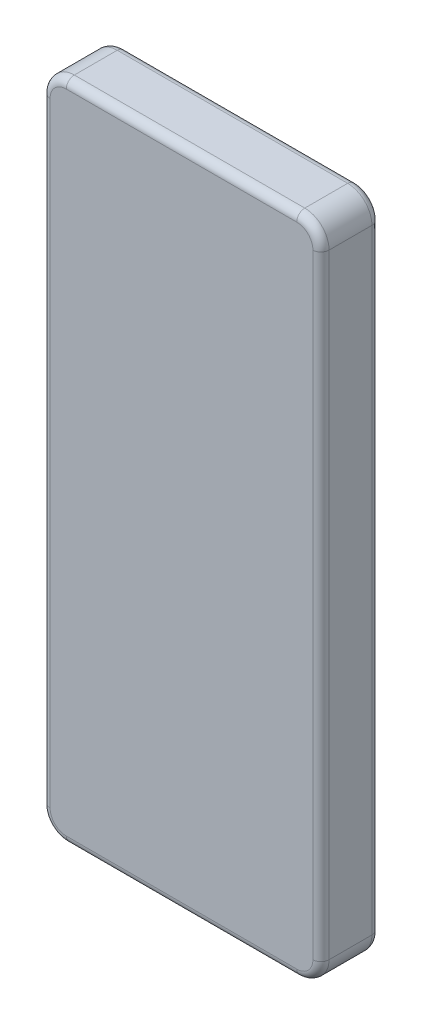
ISO-10303-21;
HEADER;
FILE_DESCRIPTION(('STEP AP214'),'2;1');
FILE_NAME('part.step','',(''),(''),'','','');
FILE_SCHEMA(('AUTOMOTIVE_DESIGN { 1 0 10303 214 1 1 1 1 }'));
ENDSEC;
DATA;
#1=APPLICATION_CONTEXT('core data for automotive mechanical design processes');
#2=APPLICATION_PROTOCOL_DEFINITION('international standard','automotive_design',2000,#1);
#3=PRODUCT_CONTEXT('',#1,'mechanical');
#4=PRODUCT('Part','Part','',(#3));
#5=PRODUCT_RELATED_PRODUCT_CATEGORY('part','',(#4));
#6=PRODUCT_DEFINITION_FORMATION('','',#4);
#7=PRODUCT_DEFINITION_CONTEXT('part definition',#1,'design');
#8=PRODUCT_DEFINITION('design','',#6,#7);
#9=PRODUCT_DEFINITION_SHAPE('','',#8);
#10=(LENGTH_UNIT() NAMED_UNIT(*) SI_UNIT(.MILLI.,.METRE.));
#11=(NAMED_UNIT(*) PLANE_ANGLE_UNIT() SI_UNIT($,.RADIAN.));
#12=(NAMED_UNIT(*) SI_UNIT($,.STERADIAN.) SOLID_ANGLE_UNIT());
#13=UNCERTAINTY_MEASURE_WITH_UNIT(LENGTH_MEASURE(1.E-05),#10,'distance_accuracy_value','');
#14=(GEOMETRIC_REPRESENTATION_CONTEXT(3) GLOBAL_UNCERTAINTY_ASSIGNED_CONTEXT((#13)) GLOBAL_UNIT_ASSIGNED_CONTEXT((#10,
#11,#12)) REPRESENTATION_CONTEXT('',''));
#15=CARTESIAN_POINT('',(0.,0.,0.));
#16=DIRECTION('',(0.,0.,1.));
#17=DIRECTION('',(1.,0.,0.));
#18=AXIS2_PLACEMENT_3D('',#15,#16,#17);
#19=CARTESIAN_POINT('',(-14.25,-38.,7.3));
#20=DIRECTION('',(0.,0.,-1.));
#21=DIRECTION('',(-1.,0.,0.));
#22=AXIS2_PLACEMENT_3D('',#19,#20,#21);
#23=CYLINDRICAL_SURFACE('',#22,3.);
#24=DIRECTION('',(0.,0.,-1.));
#25=VECTOR('',#24,1.);
#26=CARTESIAN_POINT('',(-17.25,-38.,7.3));
#27=LINE('',#26,#25);
#28=CARTESIAN_POINT('',(-17.25,-38.,6.3));
#29=VERTEX_POINT('',#28);
#30=CARTESIAN_POINT('',(-17.25,-38.,1.));
#31=VERTEX_POINT('',#30);
#32=EDGE_CURVE('E318',#29,#31,#27,.T.);
#33=ORIENTED_EDGE('',*,*,#32,.T.);
#34=CARTESIAN_POINT('',(-14.25,-38.,1.));
#35=DIRECTION('',(0.,0.,-1.));
#36=DIRECTION('',(-1.,0.,0.));
#37=AXIS2_PLACEMENT_3D('',#34,#35,#36);
#38=CIRCLE('',#37,3.);
#39=CARTESIAN_POINT('',(-14.25,-41.,1.));
#40=VERTEX_POINT('',#39);
#41=EDGE_CURVE('E267',#31,#40,#38,.F.);
#42=ORIENTED_EDGE('',*,*,#41,.T.);
#43=DIRECTION('',(0.,0.,-1.));
#44=VECTOR('',#43,1.);
#45=CARTESIAN_POINT('',(-14.25,-41.,7.3));
#46=LINE('',#45,#44);
#47=CARTESIAN_POINT('',(-14.25,-41.,6.3));
#48=VERTEX_POINT('',#47);
#49=EDGE_CURVE('E182',#48,#40,#46,.T.);
#50=ORIENTED_EDGE('',*,*,#49,.F.);
#51=CARTESIAN_POINT('',(-14.25,-38.,6.3));
#52=DIRECTION('',(0.,0.,-1.));
#53=DIRECTION('',(-1.,0.,0.));
#54=AXIS2_PLACEMENT_3D('',#51,#52,#53);
#55=CIRCLE('',#54,3.);
#56=EDGE_CURVE('E264',#48,#29,#55,.T.);
#57=ORIENTED_EDGE('',*,*,#56,.T.);
#58=EDGE_LOOP('',(#33,#42,#50,#57));
#59=FACE_BOUND('',#58,.T.);
#60=ADVANCED_FACE('F43',(#59),#23,.T.);
#61=CARTESIAN_POINT('',(-14.25,-41.,7.3));
#62=DIRECTION('',(0.,1.,0.));
#63=DIRECTION('',(0.,0.,1.));
#64=AXIS2_PLACEMENT_3D('',#61,#62,#63);
#65=PLANE('',#64);
#66=ORIENTED_EDGE('',*,*,#49,.T.);
#67=DIRECTION('',(1.,0.,0.));
#68=VECTOR('',#67,1.);
#69=CARTESIAN_POINT('',(14.25,-41.,1.));
#70=LINE('',#69,#68);
#71=CARTESIAN_POINT('',(14.25,-41.,1.));
#72=VERTEX_POINT('',#71);
#73=EDGE_CURVE('E180',#40,#72,#70,.T.);
#74=ORIENTED_EDGE('',*,*,#73,.T.);
#75=DIRECTION('',(0.,0.,-1.));
#76=VECTOR('',#75,1.);
#77=CARTESIAN_POINT('',(14.25,-41.,7.3));
#78=LINE('',#77,#76);
#79=CARTESIAN_POINT('',(14.25,-41.,6.3));
#80=VERTEX_POINT('',#79);
#81=EDGE_CURVE('E161',#80,#72,#78,.T.);
#82=ORIENTED_EDGE('',*,*,#81,.F.);
#83=DIRECTION('',(1.,0.,0.));
#84=VECTOR('',#83,1.);
#85=CARTESIAN_POINT('',(-14.25,-41.,6.3));
#86=LINE('',#85,#84);
#87=EDGE_CURVE('E177',#80,#48,#86,.F.);
#88=ORIENTED_EDGE('',*,*,#87,.T.);
#89=EDGE_LOOP('',(#66,#74,#82,#88));
#90=FACE_BOUND('',#89,.T.);
#91=ADVANCED_FACE('F175',(#90),#65,.F.);
#92=CARTESIAN_POINT('',(14.25,-38.,7.3));
#93=DIRECTION('',(0.,0.,-1.));
#94=DIRECTION('',(-1.,0.,0.));
#95=AXIS2_PLACEMENT_3D('',#92,#93,#94);
#96=CYLINDRICAL_SURFACE('',#95,3.);
#97=ORIENTED_EDGE('',*,*,#81,.T.);
#98=CARTESIAN_POINT('',(14.25,-38.,1.));
#99=DIRECTION('',(0.,0.,-1.));
#100=DIRECTION('',(-1.,0.,0.));
#101=AXIS2_PLACEMENT_3D('',#98,#99,#100);
#102=CIRCLE('',#101,3.);
#103=CARTESIAN_POINT('',(17.25,-38.,1.));
#104=VERTEX_POINT('',#103);
#105=EDGE_CURVE('E169',#72,#104,#102,.F.);
#106=ORIENTED_EDGE('',*,*,#105,.T.);
#107=DIRECTION('',(0.,0.,-1.));
#108=VECTOR('',#107,1.);
#109=CARTESIAN_POINT('',(17.25,-38.,7.3));
#110=LINE('',#109,#108);
#111=CARTESIAN_POINT('',(17.25,-38.,6.3));
#112=VERTEX_POINT('',#111);
#113=EDGE_CURVE('E163',#112,#104,#110,.T.);
#114=ORIENTED_EDGE('',*,*,#113,.F.);
#115=CARTESIAN_POINT('',(14.25,-38.,6.3));
#116=DIRECTION('',(0.,0.,-1.));
#117=DIRECTION('',(-1.,0.,0.));
#118=AXIS2_PLACEMENT_3D('',#115,#116,#117);
#119=CIRCLE('',#118,3.);
#120=EDGE_CURVE('E158',#112,#80,#119,.T.);
#121=ORIENTED_EDGE('',*,*,#120,.T.);
#122=EDGE_LOOP('',(#97,#106,#114,#121));
#123=FACE_BOUND('',#122,.T.);
#124=ADVANCED_FACE('F160',(#123),#96,.T.);
#125=CARTESIAN_POINT('',(17.25,38.,7.3));
#126=DIRECTION('',(-1.,0.,0.));
#127=DIRECTION('',(0.,-1.,0.));
#128=AXIS2_PLACEMENT_3D('',#125,#126,#127);
#129=PLANE('',#128);
#130=ORIENTED_EDGE('',*,*,#113,.T.);
#131=DIRECTION('',(0.,1.,0.));
#132=VECTOR('',#131,1.);
#133=CARTESIAN_POINT('',(17.25,38.,1.));
#134=LINE('',#133,#132);
#135=CARTESIAN_POINT('',(17.25,38.,1.));
#136=VERTEX_POINT('',#135);
#137=EDGE_CURVE('E236',#104,#136,#134,.T.);
#138=ORIENTED_EDGE('',*,*,#137,.T.);
#139=DIRECTION('',(0.,0.,-1.));
#140=VECTOR('',#139,1.);
#141=CARTESIAN_POINT('',(17.25,38.,7.3));
#142=LINE('',#141,#140);
#143=CARTESIAN_POINT('',(17.25,38.,6.3));
#144=VERTEX_POINT('',#143);
#145=EDGE_CURVE('E350',#144,#136,#142,.T.);
#146=ORIENTED_EDGE('',*,*,#145,.F.);
#147=DIRECTION('',(0.,1.,0.));
#148=VECTOR('',#147,1.);
#149=CARTESIAN_POINT('',(17.25,38.,6.3));
#150=LINE('',#149,#148);
#151=EDGE_CURVE('E233',#144,#112,#150,.F.);
#152=ORIENTED_EDGE('',*,*,#151,.T.);
#153=EDGE_LOOP('',(#130,#138,#146,#152));
#154=FACE_BOUND('',#153,.T.);
#155=ADVANCED_FACE('F347',(#154),#129,.F.);
#156=CARTESIAN_POINT('',(14.25,38.,7.3));
#157=DIRECTION('',(0.,0.,-1.));
#158=DIRECTION('',(-1.,0.,0.));
#159=AXIS2_PLACEMENT_3D('',#156,#157,#158);
#160=CYLINDRICAL_SURFACE('',#159,3.);
#161=ORIENTED_EDGE('',*,*,#145,.T.);
#162=CARTESIAN_POINT('',(14.25,38.,1.));
#163=DIRECTION('',(0.,0.,-1.));
#164=DIRECTION('',(-1.,0.,0.));
#165=AXIS2_PLACEMENT_3D('',#162,#163,#164);
#166=CIRCLE('',#165,3.);
#167=CARTESIAN_POINT('',(14.25,41.,1.));
#168=VERTEX_POINT('',#167);
#169=EDGE_CURVE('E242',#136,#168,#166,.F.);
#170=ORIENTED_EDGE('',*,*,#169,.T.);
#171=DIRECTION('',(0.,0.,-1.));
#172=VECTOR('',#171,1.);
#173=CARTESIAN_POINT('',(14.25,41.,7.3));
#174=LINE('',#173,#172);
#175=CARTESIAN_POINT('',(14.25,41.,6.3));
#176=VERTEX_POINT('',#175);
#177=EDGE_CURVE('E354',#176,#168,#174,.T.);
#178=ORIENTED_EDGE('',*,*,#177,.F.);
#179=CARTESIAN_POINT('',(14.25,38.,6.3));
#180=DIRECTION('',(0.,0.,-1.));
#181=DIRECTION('',(-1.,0.,0.));
#182=AXIS2_PLACEMENT_3D('',#179,#180,#181);
#183=CIRCLE('',#182,3.);
#184=EDGE_CURVE('E239',#176,#144,#183,.T.);
#185=ORIENTED_EDGE('',*,*,#184,.T.);
#186=EDGE_LOOP('',(#161,#170,#178,#185));
#187=FACE_BOUND('',#186,.T.);
#188=ADVANCED_FACE('F404',(#187),#160,.T.);
#189=CARTESIAN_POINT('',(-14.25,41.,7.3));
#190=DIRECTION('',(0.,-1.,0.));
#191=DIRECTION('',(0.,0.,-1.));
#192=AXIS2_PLACEMENT_3D('',#189,#190,#191);
#193=PLANE('',#192);
#194=ORIENTED_EDGE('',*,*,#177,.T.);
#195=DIRECTION('',(-1.,0.,0.));
#196=VECTOR('',#195,1.);
#197=CARTESIAN_POINT('',(-14.25,41.,1.));
#198=LINE('',#197,#196);
#199=CARTESIAN_POINT('',(-14.25,41.,1.));
#200=VERTEX_POINT('',#199);
#201=EDGE_CURVE('E248',#168,#200,#198,.T.);
#202=ORIENTED_EDGE('',*,*,#201,.T.);
#203=DIRECTION('',(0.,0.,-1.));
#204=VECTOR('',#203,1.);
#205=CARTESIAN_POINT('',(-14.25,41.,7.3));
#206=LINE('',#205,#204);
#207=CARTESIAN_POINT('',(-14.25,41.,6.3));
#208=VERTEX_POINT('',#207);
#209=EDGE_CURVE('E360',#208,#200,#206,.T.);
#210=ORIENTED_EDGE('',*,*,#209,.F.);
#211=DIRECTION('',(-1.,0.,0.));
#212=VECTOR('',#211,1.);
#213=CARTESIAN_POINT('',(-14.25,41.,6.3));
#214=LINE('',#213,#212);
#215=EDGE_CURVE('E245',#208,#176,#214,.F.);
#216=ORIENTED_EDGE('',*,*,#215,.T.);
#217=EDGE_LOOP('',(#194,#202,#210,#216));
#218=FACE_BOUND('',#217,.T.);
#219=ADVANCED_FACE('F407',(#218),#193,.F.);
#220=CARTESIAN_POINT('',(-14.25,38.,7.3));
#221=DIRECTION('',(0.,0.,-1.));
#222=DIRECTION('',(-1.,0.,0.));
#223=AXIS2_PLACEMENT_3D('',#220,#221,#222);
#224=CYLINDRICAL_SURFACE('',#223,3.);
#225=ORIENTED_EDGE('',*,*,#209,.T.);
#226=CARTESIAN_POINT('',(-14.25,38.,1.));
#227=DIRECTION('',(0.,0.,-1.));
#228=DIRECTION('',(-1.,0.,0.));
#229=AXIS2_PLACEMENT_3D('',#226,#227,#228);
#230=CIRCLE('',#229,3.);
#231=CARTESIAN_POINT('',(-17.25,38.,1.));
#232=VERTEX_POINT('',#231);
#233=EDGE_CURVE('E254',#200,#232,#230,.F.);
#234=ORIENTED_EDGE('',*,*,#233,.T.);
#235=DIRECTION('',(0.,0.,-1.));
#236=VECTOR('',#235,1.);
#237=CARTESIAN_POINT('',(-17.25,38.,7.3));
#238=LINE('',#237,#236);
#239=CARTESIAN_POINT('',(-17.25,38.,6.3));
#240=VERTEX_POINT('',#239);
#241=EDGE_CURVE('E366',#240,#232,#238,.T.);
#242=ORIENTED_EDGE('',*,*,#241,.F.);
#243=CARTESIAN_POINT('',(-14.25,38.,6.3));
#244=DIRECTION('',(0.,0.,-1.));
#245=DIRECTION('',(-1.,0.,0.));
#246=AXIS2_PLACEMENT_3D('',#243,#244,#245);
#247=CIRCLE('',#246,3.);
#248=EDGE_CURVE('E251',#240,#208,#247,.T.);
#249=ORIENTED_EDGE('',*,*,#248,.T.);
#250=EDGE_LOOP('',(#225,#234,#242,#249));
#251=FACE_BOUND('',#250,.T.);
#252=ADVANCED_FACE('F421',(#251),#224,.T.);
#253=CARTESIAN_POINT('',(-17.25,38.,7.3));
#254=DIRECTION('',(1.,0.,0.));
#255=DIRECTION('',(0.,1.,0.));
#256=AXIS2_PLACEMENT_3D('',#253,#254,#255);
#257=PLANE('',#256);
#258=ORIENTED_EDGE('',*,*,#241,.T.);
#259=DIRECTION('',(0.,-1.,0.));
#260=VECTOR('',#259,1.);
#261=CARTESIAN_POINT('',(-17.25,-38.,1.));
#262=LINE('',#261,#260);
#263=EDGE_CURVE('E261',#232,#31,#262,.T.);
#264=ORIENTED_EDGE('',*,*,#263,.T.);
#265=ORIENTED_EDGE('',*,*,#32,.F.);
#266=DIRECTION('',(0.,-1.,0.));
#267=VECTOR('',#266,1.);
#268=CARTESIAN_POINT('',(-17.25,38.,6.3));
#269=LINE('',#268,#267);
#270=EDGE_CURVE('E257',#29,#240,#269,.F.);
#271=ORIENTED_EDGE('',*,*,#270,.T.);
#272=EDGE_LOOP('',(#258,#264,#265,#271));
#273=FACE_BOUND('',#272,.T.);
#274=ADVANCED_FACE('F422',(#273),#257,.F.);
#275=CARTESIAN_POINT('',(-14.25,-38.,7.3));
#276=DIRECTION('',(0.,0.,-1.));
#277=DIRECTION('',(-1.,0.,0.));
#278=AXIS2_PLACEMENT_3D('',#275,#276,#277);
#279=PLANE('',#278);
#280=CARTESIAN_POINT('',(-14.25,38.,7.3));
#281=DIRECTION('',(0.,0.,-1.));
#282=DIRECTION('',(-1.,0.,0.));
#283=AXIS2_PLACEMENT_3D('',#280,#281,#282);
#284=CIRCLE('',#283,2.);
#285=CARTESIAN_POINT('',(-14.25,40.,7.3));
#286=VERTEX_POINT('',#285);
#287=CARTESIAN_POINT('',(-16.25,38.,7.3));
#288=VERTEX_POINT('',#287);
#289=EDGE_CURVE('E53',#286,#288,#284,.F.);
#290=ORIENTED_EDGE('',*,*,#289,.T.);
#291=DIRECTION('',(0.,-1.,0.));
#292=VECTOR('',#291,1.);
#293=CARTESIAN_POINT('',(-16.25,-38.,7.3));
#294=LINE('',#293,#292);
#295=CARTESIAN_POINT('',(-16.25,-38.,7.3));
#296=VERTEX_POINT('',#295);
#297=EDGE_CURVE('E11',#288,#296,#294,.T.);
#298=ORIENTED_EDGE('',*,*,#297,.T.);
#299=CARTESIAN_POINT('',(-14.25,-38.,7.3));
#300=DIRECTION('',(0.,0.,-1.));
#301=DIRECTION('',(-1.,0.,0.));
#302=AXIS2_PLACEMENT_3D('',#299,#300,#301);
#303=CIRCLE('',#302,2.);
#304=CARTESIAN_POINT('',(-14.25,-40.,7.3));
#305=VERTEX_POINT('',#304);
#306=EDGE_CURVE('E270',#296,#305,#303,.F.);
#307=ORIENTED_EDGE('',*,*,#306,.T.);
#308=DIRECTION('',(1.,0.,0.));
#309=VECTOR('',#308,1.);
#310=CARTESIAN_POINT('',(-14.25,-40.,7.3));
#311=LINE('',#310,#309);
#312=CARTESIAN_POINT('',(14.25,-40.,7.3));
#313=VERTEX_POINT('',#312);
#314=EDGE_CURVE('E273',#305,#313,#311,.T.);
#315=ORIENTED_EDGE('',*,*,#314,.T.);
#316=CARTESIAN_POINT('',(14.25,-38.,7.3));
#317=DIRECTION('',(0.,0.,-1.));
#318=DIRECTION('',(-1.,0.,0.));
#319=AXIS2_PLACEMENT_3D('',#316,#317,#318);
#320=CIRCLE('',#319,2.);
#321=CARTESIAN_POINT('',(16.25,-38.,7.3));
#322=VERTEX_POINT('',#321);
#323=EDGE_CURVE('E188',#313,#322,#320,.F.);
#324=ORIENTED_EDGE('',*,*,#323,.T.);
#325=DIRECTION('',(0.,1.,0.));
#326=VECTOR('',#325,1.);
#327=CARTESIAN_POINT('',(16.25,-38.,7.3));
#328=LINE('',#327,#326);
#329=CARTESIAN_POINT('',(16.25,38.,7.3));
#330=VERTEX_POINT('',#329);
#331=EDGE_CURVE('E278',#322,#330,#328,.T.);
#332=ORIENTED_EDGE('',*,*,#331,.T.);
#333=CARTESIAN_POINT('',(14.25,38.,7.3));
#334=DIRECTION('',(0.,0.,-1.));
#335=DIRECTION('',(-1.,0.,0.));
#336=AXIS2_PLACEMENT_3D('',#333,#334,#335);
#337=CIRCLE('',#336,2.);
#338=CARTESIAN_POINT('',(14.25,40.,7.3));
#339=VERTEX_POINT('',#338);
#340=EDGE_CURVE('E281',#330,#339,#337,.F.);
#341=ORIENTED_EDGE('',*,*,#340,.T.);
#342=DIRECTION('',(-1.,0.,0.));
#343=VECTOR('',#342,1.);
#344=CARTESIAN_POINT('',(-14.25,40.,7.3));
#345=LINE('',#344,#343);
#346=EDGE_CURVE('E64',#339,#286,#345,.T.);
#347=ORIENTED_EDGE('',*,*,#346,.T.);
#348=EDGE_LOOP('',(#290,#298,#307,#315,#324,#332,#341,#347));
#349=FACE_BOUND('',#348,.T.);
#350=ADVANCED_FACE('F431',(#349),#279,.F.);
#351=CARTESIAN_POINT('',(-14.25,-38.,0.));
#352=DIRECTION('',(0.,0.,-1.));
#353=DIRECTION('',(-1.,0.,0.));
#354=AXIS2_PLACEMENT_3D('',#351,#352,#353);
#355=PLANE('',#354);
#356=CARTESIAN_POINT('',(14.25,-38.,0.));
#357=DIRECTION('',(0.,0.,-1.));
#358=DIRECTION('',(-1.,0.,0.));
#359=AXIS2_PLACEMENT_3D('',#356,#357,#358);
#360=CIRCLE('',#359,2.);
#361=CARTESIAN_POINT('',(16.25,-38.,0.));
#362=VERTEX_POINT('',#361);
#363=CARTESIAN_POINT('',(14.25,-40.,0.));
#364=VERTEX_POINT('',#363);
#365=EDGE_CURVE('E225',#362,#364,#360,.T.);
#366=ORIENTED_EDGE('',*,*,#365,.T.);
#367=DIRECTION('',(1.,0.,0.));
#368=VECTOR('',#367,1.);
#369=CARTESIAN_POINT('',(-14.25,-40.,0.));
#370=LINE('',#369,#368);
#371=CARTESIAN_POINT('',(-14.25,-40.,0.));
#372=VERTEX_POINT('',#371);
#373=EDGE_CURVE('E170',#364,#372,#370,.F.);
#374=ORIENTED_EDGE('',*,*,#373,.T.);
#375=CARTESIAN_POINT('',(-14.25,-38.,0.));
#376=DIRECTION('',(0.,0.,-1.));
#377=DIRECTION('',(-1.,0.,0.));
#378=AXIS2_PLACEMENT_3D('',#375,#376,#377);
#379=CIRCLE('',#378,2.);
#380=CARTESIAN_POINT('',(-16.25,-38.,0.));
#381=VERTEX_POINT('',#380);
#382=EDGE_CURVE('E204',#372,#381,#379,.T.);
#383=ORIENTED_EDGE('',*,*,#382,.T.);
#384=DIRECTION('',(0.,-1.,0.));
#385=VECTOR('',#384,1.);
#386=CARTESIAN_POINT('',(-16.25,38.,0.));
#387=LINE('',#386,#385);
#388=CARTESIAN_POINT('',(-16.25,38.,0.));
#389=VERTEX_POINT('',#388);
#390=EDGE_CURVE('E210',#381,#389,#387,.F.);
#391=ORIENTED_EDGE('',*,*,#390,.T.);
#392=CARTESIAN_POINT('',(-14.25,38.,0.));
#393=DIRECTION('',(0.,0.,-1.));
#394=DIRECTION('',(-1.,0.,0.));
#395=AXIS2_PLACEMENT_3D('',#392,#393,#394);
#396=CIRCLE('',#395,2.);
#397=CARTESIAN_POINT('',(-14.25,40.,0.));
#398=VERTEX_POINT('',#397);
#399=EDGE_CURVE('E213',#389,#398,#396,.T.);
#400=ORIENTED_EDGE('',*,*,#399,.T.);
#401=DIRECTION('',(-1.,0.,0.));
#402=VECTOR('',#401,1.);
#403=CARTESIAN_POINT('',(14.25,40.,0.));
#404=LINE('',#403,#402);
#405=CARTESIAN_POINT('',(14.25,40.,0.));
#406=VERTEX_POINT('',#405);
#407=EDGE_CURVE('E216',#398,#406,#404,.F.);
#408=ORIENTED_EDGE('',*,*,#407,.T.);
#409=CARTESIAN_POINT('',(14.25,38.,0.));
#410=DIRECTION('',(0.,0.,-1.));
#411=DIRECTION('',(-1.,0.,0.));
#412=AXIS2_PLACEMENT_3D('',#409,#410,#411);
#413=CIRCLE('',#412,2.);
#414=CARTESIAN_POINT('',(16.25,38.,0.));
#415=VERTEX_POINT('',#414);
#416=EDGE_CURVE('E219',#406,#415,#413,.T.);
#417=ORIENTED_EDGE('',*,*,#416,.T.);
#418=DIRECTION('',(0.,1.,0.));
#419=VECTOR('',#418,1.);
#420=CARTESIAN_POINT('',(16.25,-38.,0.));
#421=LINE('',#420,#419);
#422=EDGE_CURVE('E222',#415,#362,#421,.F.);
#423=ORIENTED_EDGE('',*,*,#422,.T.);
#424=EDGE_LOOP('',(#366,#374,#383,#391,#400,#408,#417,#423));
#425=FACE_BOUND('',#424,.T.);
#426=ADVANCED_FACE('F433',(#425),#355,.T.);
#427=CARTESIAN_POINT('',(-14.25,40.,1.));
#428=DIRECTION('',(1.,0.,0.));
#429=DIRECTION('',(0.,0.,-1.));
#430=AXIS2_PLACEMENT_3D('',#427,#428,#429);
#431=CYLINDRICAL_SURFACE('',#430,1.);
#432=CARTESIAN_POINT('',(14.25,40.,1.));
#433=DIRECTION('',(1.,0.,0.));
#434=DIRECTION('',(0.,1.,0.));
#435=AXIS2_PLACEMENT_3D('',#432,#433,#434);
#436=CIRCLE('',#435,1.);
#437=EDGE_CURVE('E310',#406,#168,#436,.T.);
#438=ORIENTED_EDGE('',*,*,#437,.F.);
#439=ORIENTED_EDGE('',*,*,#407,.F.);
#440=CARTESIAN_POINT('',(-14.25,40.,1.));
#441=DIRECTION('',(-1.,0.,0.));
#442=DIRECTION('',(0.,0.,1.));
#443=AXIS2_PLACEMENT_3D('',#440,#441,#442);
#444=CIRCLE('',#443,1.);
#445=EDGE_CURVE('E314',#200,#398,#444,.T.);
#446=ORIENTED_EDGE('',*,*,#445,.F.);
#447=ORIENTED_EDGE('',*,*,#201,.F.);
#448=EDGE_LOOP('',(#438,#439,#446,#447));
#449=FACE_BOUND('',#448,.T.);
#450=ADVANCED_FACE('F412',(#449),#431,.T.);
#451=CARTESIAN_POINT('',(-14.25,38.,1.));
#452=DIRECTION('',(0.,0.,-1.));
#453=DIRECTION('',(-1.,0.,0.));
#454=AXIS2_PLACEMENT_3D('',#451,#452,#453);
#455=TOROIDAL_SURFACE('',#454,2.,1.);
#456=ORIENTED_EDGE('',*,*,#445,.T.);
#457=ORIENTED_EDGE('',*,*,#399,.F.);
#458=CARTESIAN_POINT('',(-16.25,38.,1.));
#459=DIRECTION('',(0.,-1.,0.));
#460=DIRECTION('',(1.,0.,0.));
#461=AXIS2_PLACEMENT_3D('',#458,#459,#460);
#462=CIRCLE('',#461,1.);
#463=EDGE_CURVE('E306',#232,#389,#462,.T.);
#464=ORIENTED_EDGE('',*,*,#463,.F.);
#465=ORIENTED_EDGE('',*,*,#233,.F.);
#466=EDGE_LOOP('',(#456,#457,#464,#465));
#467=FACE_BOUND('',#466,.T.);
#468=ADVANCED_FACE('F418',(#467),#455,.T.);
#469=CARTESIAN_POINT('',(14.25,38.,1.));
#470=DIRECTION('',(0.,0.,-1.));
#471=DIRECTION('',(-1.,0.,0.));
#472=AXIS2_PLACEMENT_3D('',#469,#470,#471);
#473=TOROIDAL_SURFACE('',#472,2.,1.);
#474=ORIENTED_EDGE('',*,*,#437,.T.);
#475=ORIENTED_EDGE('',*,*,#169,.F.);
#476=CARTESIAN_POINT('',(16.25,38.,1.));
#477=DIRECTION('',(0.,-1.,0.));
#478=DIRECTION('',(0.,0.,-1.));
#479=AXIS2_PLACEMENT_3D('',#476,#477,#478);
#480=CIRCLE('',#479,1.);
#481=EDGE_CURVE('E302',#415,#136,#480,.T.);
#482=ORIENTED_EDGE('',*,*,#481,.F.);
#483=ORIENTED_EDGE('',*,*,#416,.F.);
#484=EDGE_LOOP('',(#474,#475,#482,#483));
#485=FACE_BOUND('',#484,.T.);
#486=ADVANCED_FACE('F401',(#485),#473,.T.);
#487=CARTESIAN_POINT('',(-16.25,38.,1.));
#488=DIRECTION('',(0.,1.,0.));
#489=DIRECTION('',(-1.,0.,0.));
#490=AXIS2_PLACEMENT_3D('',#487,#488,#489);
#491=CYLINDRICAL_SURFACE('',#490,1.);
#492=ORIENTED_EDGE('',*,*,#463,.T.);
#493=ORIENTED_EDGE('',*,*,#390,.F.);
#494=CARTESIAN_POINT('',(-16.25,-38.,1.));
#495=DIRECTION('',(0.,-1.,0.));
#496=DIRECTION('',(0.,0.,-1.));
#497=AXIS2_PLACEMENT_3D('',#494,#495,#496);
#498=CIRCLE('',#497,1.);
#499=EDGE_CURVE('E298',#31,#381,#498,.T.);
#500=ORIENTED_EDGE('',*,*,#499,.F.);
#501=ORIENTED_EDGE('',*,*,#263,.F.);
#502=EDGE_LOOP('',(#492,#493,#500,#501));
#503=FACE_BOUND('',#502,.T.);
#504=ADVANCED_FACE('F381',(#503),#491,.T.);
#505=CARTESIAN_POINT('',(16.25,38.,1.));
#506=DIRECTION('',(0.,-1.,0.));
#507=DIRECTION('',(1.,0.,0.));
#508=AXIS2_PLACEMENT_3D('',#505,#506,#507);
#509=CYLINDRICAL_SURFACE('',#508,1.);
#510=ORIENTED_EDGE('',*,*,#481,.T.);
#511=ORIENTED_EDGE('',*,*,#137,.F.);
#512=CARTESIAN_POINT('',(16.25,-38.,1.));
#513=DIRECTION('',(0.,-1.,0.));
#514=DIRECTION('',(0.,0.,-1.));
#515=AXIS2_PLACEMENT_3D('',#512,#513,#514);
#516=CIRCLE('',#515,1.);
#517=EDGE_CURVE('E294',#362,#104,#516,.T.);
#518=ORIENTED_EDGE('',*,*,#517,.F.);
#519=ORIENTED_EDGE('',*,*,#422,.F.);
#520=EDGE_LOOP('',(#510,#511,#518,#519));
#521=FACE_BOUND('',#520,.T.);
#522=ADVANCED_FACE('F397',(#521),#509,.T.);
#523=CARTESIAN_POINT('',(-14.25,-38.,1.));
#524=DIRECTION('',(0.,0.,-1.));
#525=DIRECTION('',(-1.,0.,0.));
#526=AXIS2_PLACEMENT_3D('',#523,#524,#525);
#527=TOROIDAL_SURFACE('',#526,2.,1.);
#528=ORIENTED_EDGE('',*,*,#499,.T.);
#529=ORIENTED_EDGE('',*,*,#382,.F.);
#530=CARTESIAN_POINT('',(-14.25,-40.,1.));
#531=DIRECTION('',(1.,0.,0.));
#532=DIRECTION('',(0.,0.,-1.));
#533=AXIS2_PLACEMENT_3D('',#530,#531,#532);
#534=CIRCLE('',#533,1.);
#535=EDGE_CURVE('E291',#40,#372,#534,.T.);
#536=ORIENTED_EDGE('',*,*,#535,.F.);
#537=ORIENTED_EDGE('',*,*,#41,.F.);
#538=EDGE_LOOP('',(#528,#529,#536,#537));
#539=FACE_BOUND('',#538,.T.);
#540=ADVANCED_FACE('F385',(#539),#527,.T.);
#541=CARTESIAN_POINT('',(14.25,-38.,1.));
#542=DIRECTION('',(0.,0.,-1.));
#543=DIRECTION('',(-1.,0.,0.));
#544=AXIS2_PLACEMENT_3D('',#541,#542,#543);
#545=TOROIDAL_SURFACE('',#544,2.,1.);
#546=ORIENTED_EDGE('',*,*,#517,.T.);
#547=ORIENTED_EDGE('',*,*,#105,.F.);
#548=CARTESIAN_POINT('',(14.25,-40.,1.));
#549=DIRECTION('',(-1.,0.,0.));
#550=DIRECTION('',(0.,0.,1.));
#551=AXIS2_PLACEMENT_3D('',#548,#549,#550);
#552=CIRCLE('',#551,1.);
#553=EDGE_CURVE('E288',#364,#72,#552,.T.);
#554=ORIENTED_EDGE('',*,*,#553,.F.);
#555=ORIENTED_EDGE('',*,*,#365,.F.);
#556=EDGE_LOOP('',(#546,#547,#554,#555));
#557=FACE_BOUND('',#556,.T.);
#558=ADVANCED_FACE('F393',(#557),#545,.T.);
#559=CARTESIAN_POINT('',(-14.25,-40.,1.));
#560=DIRECTION('',(-1.,0.,0.));
#561=DIRECTION('',(0.,0.,1.));
#562=AXIS2_PLACEMENT_3D('',#559,#560,#561);
#563=CYLINDRICAL_SURFACE('',#562,1.);
#564=ORIENTED_EDGE('',*,*,#535,.T.);
#565=ORIENTED_EDGE('',*,*,#373,.F.);
#566=ORIENTED_EDGE('',*,*,#553,.T.);
#567=ORIENTED_EDGE('',*,*,#73,.F.);
#568=EDGE_LOOP('',(#564,#565,#566,#567));
#569=FACE_BOUND('',#568,.T.);
#570=ADVANCED_FACE('F388',(#569),#563,.T.);
#571=CARTESIAN_POINT('',(16.25,-38.,6.3));
#572=DIRECTION('',(0.,1.,0.));
#573=DIRECTION('',(-1.,0.,0.));
#574=AXIS2_PLACEMENT_3D('',#571,#572,#573);
#575=CYLINDRICAL_SURFACE('',#574,1.);
#576=CARTESIAN_POINT('',(16.25,-38.,6.3));
#577=DIRECTION('',(0.,-1.,0.));
#578=DIRECTION('',(0.,0.,-1.));
#579=AXIS2_PLACEMENT_3D('',#576,#577,#578);
#580=CIRCLE('',#579,1.);
#581=EDGE_CURVE('E332',#112,#322,#580,.T.);
#582=ORIENTED_EDGE('',*,*,#581,.F.);
#583=ORIENTED_EDGE('',*,*,#151,.F.);
#584=CARTESIAN_POINT('',(16.25,38.,6.3));
#585=DIRECTION('',(0.,1.,0.));
#586=DIRECTION('',(-1.,0.,0.));
#587=AXIS2_PLACEMENT_3D('',#584,#585,#586);
#588=CIRCLE('',#587,1.);
#589=EDGE_CURVE('E47',#330,#144,#588,.T.);
#590=ORIENTED_EDGE('',*,*,#589,.F.);
#591=ORIENTED_EDGE('',*,*,#331,.F.);
#592=EDGE_LOOP('',(#582,#583,#590,#591));
#593=FACE_BOUND('',#592,.T.);
#594=ADVANCED_FACE('F45',(#593),#575,.T.);
#595=CARTESIAN_POINT('',(14.25,38.,6.3));
#596=DIRECTION('',(0.,0.,-1.));
#597=DIRECTION('',(-1.,0.,0.));
#598=AXIS2_PLACEMENT_3D('',#595,#596,#597);
#599=TOROIDAL_SURFACE('',#598,2.,1.);
#600=ORIENTED_EDGE('',*,*,#589,.T.);
#601=ORIENTED_EDGE('',*,*,#184,.F.);
#602=CARTESIAN_POINT('',(14.25,40.,6.3));
#603=DIRECTION('',(-1.,0.,0.));
#604=DIRECTION('',(0.,0.,1.));
#605=AXIS2_PLACEMENT_3D('',#602,#603,#604);
#606=CIRCLE('',#605,1.);
#607=EDGE_CURVE('E192',#339,#176,#606,.T.);
#608=ORIENTED_EDGE('',*,*,#607,.F.);
#609=ORIENTED_EDGE('',*,*,#340,.F.);
#610=EDGE_LOOP('',(#600,#601,#608,#609));
#611=FACE_BOUND('',#610,.T.);
#612=ADVANCED_FACE('F340',(#611),#599,.T.);
#613=CARTESIAN_POINT('',(14.25,-38.,6.3));
#614=DIRECTION('',(0.,0.,-1.));
#615=DIRECTION('',(-1.,0.,0.));
#616=AXIS2_PLACEMENT_3D('',#613,#614,#615);
#617=TOROIDAL_SURFACE('',#616,2.,1.);
#618=ORIENTED_EDGE('',*,*,#581,.T.);
#619=ORIENTED_EDGE('',*,*,#323,.F.);
#620=CARTESIAN_POINT('',(14.25,-40.,6.3));
#621=DIRECTION('',(-1.,0.,0.));
#622=DIRECTION('',(0.,-1.,0.));
#623=AXIS2_PLACEMENT_3D('',#620,#621,#622);
#624=CIRCLE('',#623,1.);
#625=EDGE_CURVE('E186',#80,#313,#624,.T.);
#626=ORIENTED_EDGE('',*,*,#625,.F.);
#627=ORIENTED_EDGE('',*,*,#120,.F.);
#628=EDGE_LOOP('',(#618,#619,#626,#627));
#629=FACE_BOUND('',#628,.T.);
#630=ADVANCED_FACE('F187',(#629),#617,.T.);
#631=CARTESIAN_POINT('',(-14.25,40.,6.3));
#632=DIRECTION('',(-1.,0.,0.));
#633=DIRECTION('',(0.,0.,1.));
#634=AXIS2_PLACEMENT_3D('',#631,#632,#633);
#635=CYLINDRICAL_SURFACE('',#634,1.);
#636=ORIENTED_EDGE('',*,*,#607,.T.);
#637=ORIENTED_EDGE('',*,*,#215,.F.);
#638=CARTESIAN_POINT('',(-14.25,40.,6.3));
#639=DIRECTION('',(-1.,0.,0.));
#640=DIRECTION('',(0.,-1.,0.));
#641=AXIS2_PLACEMENT_3D('',#638,#639,#640);
#642=CIRCLE('',#641,1.);
#643=EDGE_CURVE('E193',#286,#208,#642,.T.);
#644=ORIENTED_EDGE('',*,*,#643,.F.);
#645=ORIENTED_EDGE('',*,*,#346,.F.);
#646=EDGE_LOOP('',(#636,#637,#644,#645));
#647=FACE_BOUND('',#646,.T.);
#648=ADVANCED_FACE('F476',(#647),#635,.T.);
#649=CARTESIAN_POINT('',(-14.25,-40.,6.3));
#650=DIRECTION('',(1.,0.,0.));
#651=DIRECTION('',(0.,0.,-1.));
#652=AXIS2_PLACEMENT_3D('',#649,#650,#651);
#653=CYLINDRICAL_SURFACE('',#652,1.);
#654=ORIENTED_EDGE('',*,*,#625,.T.);
#655=ORIENTED_EDGE('',*,*,#314,.F.);
#656=CARTESIAN_POINT('',(-14.25,-40.,6.3));
#657=DIRECTION('',(-1.,0.,0.));
#658=DIRECTION('',(0.,0.,1.));
#659=AXIS2_PLACEMENT_3D('',#656,#657,#658);
#660=CIRCLE('',#659,1.);
#661=EDGE_CURVE('E198',#48,#305,#660,.T.);
#662=ORIENTED_EDGE('',*,*,#661,.F.);
#663=ORIENTED_EDGE('',*,*,#87,.F.);
#664=EDGE_LOOP('',(#654,#655,#662,#663));
#665=FACE_BOUND('',#664,.T.);
#666=ADVANCED_FACE('F196',(#665),#653,.T.);
#667=CARTESIAN_POINT('',(-14.25,38.,6.3));
#668=DIRECTION('',(0.,0.,-1.));
#669=DIRECTION('',(-1.,0.,0.));
#670=AXIS2_PLACEMENT_3D('',#667,#668,#669);
#671=TOROIDAL_SURFACE('',#670,2.,1.);
#672=ORIENTED_EDGE('',*,*,#643,.T.);
#673=ORIENTED_EDGE('',*,*,#248,.F.);
#674=CARTESIAN_POINT('',(-16.25,38.,6.3));
#675=DIRECTION('',(0.,-1.,0.));
#676=DIRECTION('',(0.,0.,-1.));
#677=AXIS2_PLACEMENT_3D('',#674,#675,#676);
#678=CIRCLE('',#677,1.);
#679=EDGE_CURVE('E322',#288,#240,#678,.T.);
#680=ORIENTED_EDGE('',*,*,#679,.F.);
#681=ORIENTED_EDGE('',*,*,#289,.F.);
#682=EDGE_LOOP('',(#672,#673,#680,#681));
#683=FACE_BOUND('',#682,.T.);
#684=ADVANCED_FACE('F470',(#683),#671,.T.);
#685=CARTESIAN_POINT('',(-14.25,-38.,6.3));
#686=DIRECTION('',(0.,0.,-1.));
#687=DIRECTION('',(-1.,0.,0.));
#688=AXIS2_PLACEMENT_3D('',#685,#686,#687);
#689=TOROIDAL_SURFACE('',#688,2.,1.);
#690=ORIENTED_EDGE('',*,*,#661,.T.);
#691=ORIENTED_EDGE('',*,*,#306,.F.);
#692=CARTESIAN_POINT('',(-16.25,-38.,6.3));
#693=DIRECTION('',(0.,1.,0.));
#694=DIRECTION('',(-1.,0.,0.));
#695=AXIS2_PLACEMENT_3D('',#692,#693,#694);
#696=CIRCLE('',#695,1.);
#697=EDGE_CURVE('E319',#29,#296,#696,.T.);
#698=ORIENTED_EDGE('',*,*,#697,.F.);
#699=ORIENTED_EDGE('',*,*,#56,.F.);
#700=EDGE_LOOP('',(#690,#691,#698,#699));
#701=FACE_BOUND('',#700,.T.);
#702=ADVANCED_FACE('F430',(#701),#689,.T.);
#703=CARTESIAN_POINT('',(-16.25,-38.,6.3));
#704=DIRECTION('',(0.,-1.,0.));
#705=DIRECTION('',(1.,0.,0.));
#706=AXIS2_PLACEMENT_3D('',#703,#704,#705);
#707=CYLINDRICAL_SURFACE('',#706,1.);
#708=ORIENTED_EDGE('',*,*,#679,.T.);
#709=ORIENTED_EDGE('',*,*,#270,.F.);
#710=ORIENTED_EDGE('',*,*,#697,.T.);
#711=ORIENTED_EDGE('',*,*,#297,.F.);
#712=EDGE_LOOP('',(#708,#709,#710,#711));
#713=FACE_BOUND('',#712,.T.);
#714=ADVANCED_FACE('F425',(#713),#707,.T.);
#715=CLOSED_SHELL('',(#60,#91,#124,#155,#188,#219,#252,#274,#350,#426,#450,#468,#486,#504,#522,
#540,#558,#570,#594,#612,#630,#648,#666,#684,#702,#714));
#716=MANIFOLD_SOLID_BREP('B2',#715);
#717=ADVANCED_BREP_SHAPE_REPRESENTATION('',(#18,#716),#14);
#718=SHAPE_DEFINITION_REPRESENTATION(#9,#717);
ENDSEC;
END-ISO-10303-21;
